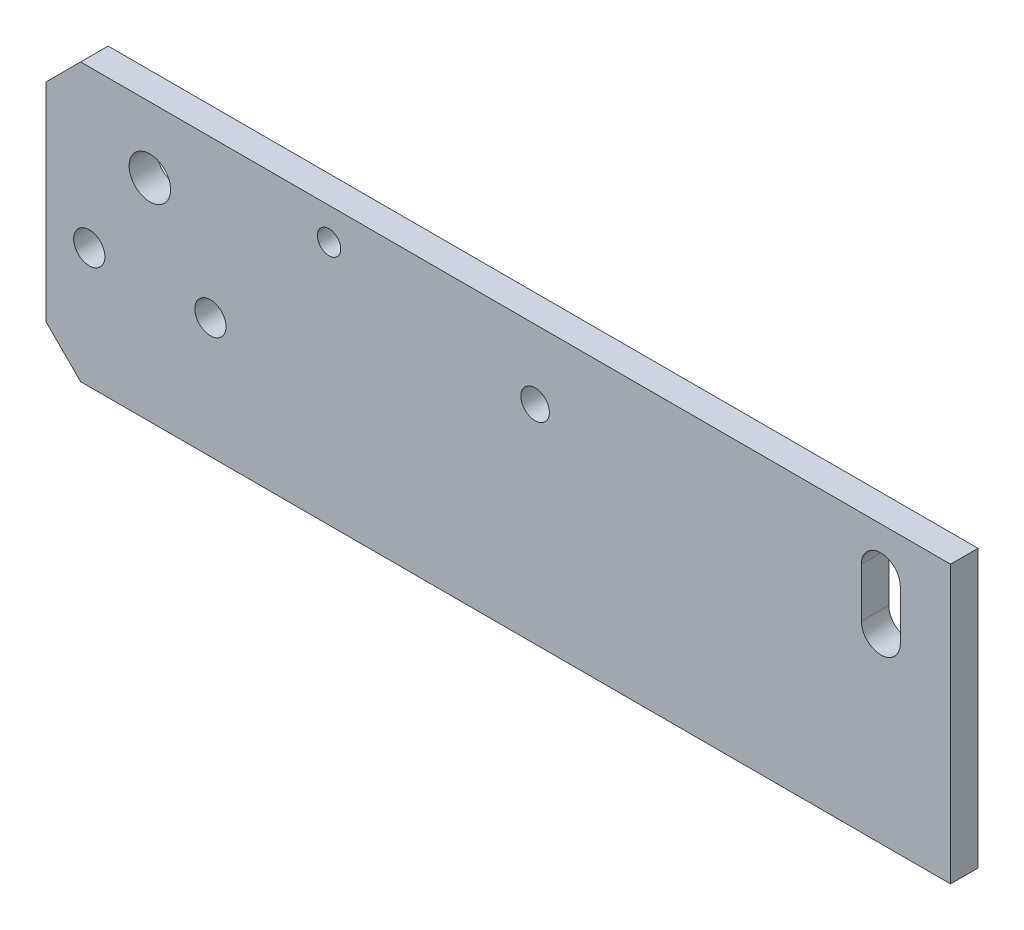
ISO-10303-21;
HEADER;
FILE_DESCRIPTION(('STEP AP214'),'2;1');
FILE_NAME('part.step','',(''),(''),'','','');
FILE_SCHEMA(('AUTOMOTIVE_DESIGN { 1 0 10303 214 1 1 1 1 }'));
ENDSEC;
DATA;
#1=APPLICATION_CONTEXT('core data for automotive mechanical design processes');
#2=APPLICATION_PROTOCOL_DEFINITION('international standard','automotive_design',2000,#1);
#3=PRODUCT_CONTEXT('',#1,'mechanical');
#4=PRODUCT('Part','Part','',(#3));
#5=PRODUCT_RELATED_PRODUCT_CATEGORY('part','',(#4));
#6=PRODUCT_DEFINITION_FORMATION('','',#4);
#7=PRODUCT_DEFINITION_CONTEXT('part definition',#1,'design');
#8=PRODUCT_DEFINITION('design','',#6,#7);
#9=PRODUCT_DEFINITION_SHAPE('','',#8);
#10=(LENGTH_UNIT() NAMED_UNIT(*) SI_UNIT(.MILLI.,.METRE.));
#11=(NAMED_UNIT(*) PLANE_ANGLE_UNIT() SI_UNIT($,.RADIAN.));
#12=(NAMED_UNIT(*) SI_UNIT($,.STERADIAN.) SOLID_ANGLE_UNIT());
#13=UNCERTAINTY_MEASURE_WITH_UNIT(LENGTH_MEASURE(1.E-05),#10,'distance_accuracy_value','');
#14=(GEOMETRIC_REPRESENTATION_CONTEXT(3) GLOBAL_UNCERTAINTY_ASSIGNED_CONTEXT((#13)) GLOBAL_UNIT_ASSIGNED_CONTEXT((#10,
#11,#12)) REPRESENTATION_CONTEXT('',''));
#15=CARTESIAN_POINT('',(0.,0.,0.));
#16=DIRECTION('',(0.,0.,1.));
#17=DIRECTION('',(1.,0.,0.));
#18=AXIS2_PLACEMENT_3D('',#15,#16,#17);
#19=CARTESIAN_POINT('',(28.,33.,-3.175));
#20=DIRECTION('',(1.,0.,0.));
#21=DIRECTION('',(0.,1.,0.));
#22=AXIS2_PLACEMENT_3D('',#19,#20,#21);
#23=PLANE('',#22);
#24=DIRECTION('',(0.,1.,0.));
#25=VECTOR('',#24,1.);
#26=CARTESIAN_POINT('',(28.,33.,0.));
#27=LINE('',#26,#25);
#28=CARTESIAN_POINT('',(28.,1.,0.));
#29=VERTEX_POINT('',#28);
#30=CARTESIAN_POINT('',(28.,33.,0.));
#31=VERTEX_POINT('',#30);
#32=EDGE_CURVE('E178',#29,#31,#27,.T.);
#33=ORIENTED_EDGE('',*,*,#32,.F.);
#34=DIRECTION('',(0.,0.,1.));
#35=VECTOR('',#34,1.);
#36=CARTESIAN_POINT('',(28.,1.,-3.175));
#37=LINE('',#36,#35);
#38=CARTESIAN_POINT('',(28.,1.,-3.175));
#39=VERTEX_POINT('',#38);
#40=EDGE_CURVE('E202',#39,#29,#37,.T.);
#41=ORIENTED_EDGE('',*,*,#40,.F.);
#42=DIRECTION('',(0.,1.,0.));
#43=VECTOR('',#42,1.);
#44=CARTESIAN_POINT('',(28.,33.,-3.175));
#45=LINE('',#44,#43);
#46=CARTESIAN_POINT('',(28.,33.,-3.175));
#47=VERTEX_POINT('',#46);
#48=EDGE_CURVE('E181',#39,#47,#45,.T.);
#49=ORIENTED_EDGE('',*,*,#48,.T.);
#50=DIRECTION('',(0.,0.,1.));
#51=VECTOR('',#50,1.);
#52=CARTESIAN_POINT('',(28.,33.,-3.175));
#53=LINE('',#52,#51);
#54=EDGE_CURVE('E192',#47,#31,#53,.T.);
#55=ORIENTED_EDGE('',*,*,#54,.T.);
#56=EDGE_LOOP('',(#33,#41,#49,#55));
#57=FACE_BOUND('',#56,.T.);
#58=ADVANCED_FACE('F47',(#57),#23,.T.);
#59=CARTESIAN_POINT('',(28.,1.,-3.175));
#60=DIRECTION('',(0.,-1.,0.));
#61=DIRECTION('',(1.,0.,0.));
#62=AXIS2_PLACEMENT_3D('',#59,#60,#61);
#63=PLANE('',#62);
#64=DIRECTION('',(1.,0.,0.));
#65=VECTOR('',#64,1.);
#66=CARTESIAN_POINT('',(28.,1.,0.));
#67=LINE('',#66,#65);
#68=CARTESIAN_POINT('',(-72.5160000000001,0.999999999999987,0.));
#69=VERTEX_POINT('',#68);
#70=EDGE_CURVE('E185',#69,#29,#67,.T.);
#71=ORIENTED_EDGE('',*,*,#70,.F.);
#72=DIRECTION('',(0.,0.,-1.));
#73=VECTOR('',#72,1.);
#74=CARTESIAN_POINT('',(-72.5160000000001,0.999999999999987,-3.175));
#75=LINE('',#74,#73);
#76=CARTESIAN_POINT('',(-72.5160000000001,0.999999999999987,-3.175));
#77=VERTEX_POINT('',#76);
#78=EDGE_CURVE('E70',#69,#77,#75,.T.);
#79=ORIENTED_EDGE('',*,*,#78,.T.);
#80=DIRECTION('',(1.,0.,0.));
#81=VECTOR('',#80,1.);
#82=CARTESIAN_POINT('',(28.,1.,-3.175));
#83=LINE('',#82,#81);
#84=EDGE_CURVE('E190',#77,#39,#83,.T.);
#85=ORIENTED_EDGE('',*,*,#84,.T.);
#86=ORIENTED_EDGE('',*,*,#40,.T.);
#87=EDGE_LOOP('',(#71,#79,#85,#86));
#88=FACE_BOUND('',#87,.T.);
#89=ADVANCED_FACE('F227',(#88),#63,.T.);
#90=CARTESIAN_POINT('',(-76.5160000000001,33.,-3.175));
#91=DIRECTION('',(-1.,0.,0.));
#92=DIRECTION('',(0.,-1.,0.));
#93=AXIS2_PLACEMENT_3D('',#90,#91,#92);
#94=PLANE('',#93);
#95=DIRECTION('',(0.,-1.,0.));
#96=VECTOR('',#95,1.);
#97=CARTESIAN_POINT('',(-76.5160000000001,33.,-3.175));
#98=LINE('',#97,#96);
#99=CARTESIAN_POINT('',(-76.5160000000001,29.,-3.175));
#100=VERTEX_POINT('',#99);
#101=CARTESIAN_POINT('',(-76.5160000000001,4.99999999999999,-3.175));
#102=VERTEX_POINT('',#101);
#103=EDGE_CURVE('E187',#100,#102,#98,.T.);
#104=ORIENTED_EDGE('',*,*,#103,.T.);
#105=DIRECTION('',(0.,0.,1.));
#106=VECTOR('',#105,1.);
#107=CARTESIAN_POINT('',(-76.5160000000001,4.99999999999999,-3.175));
#108=LINE('',#107,#106);
#109=CARTESIAN_POINT('',(-76.5160000000001,4.99999999999999,0.));
#110=VERTEX_POINT('',#109);
#111=EDGE_CURVE('E208',#102,#110,#108,.T.);
#112=ORIENTED_EDGE('',*,*,#111,.T.);
#113=DIRECTION('',(0.,-1.,0.));
#114=VECTOR('',#113,1.);
#115=CARTESIAN_POINT('',(-76.5160000000001,33.,0.));
#116=LINE('',#115,#114);
#117=CARTESIAN_POINT('',(-76.5160000000001,29.,0.));
#118=VERTEX_POINT('',#117);
#119=EDGE_CURVE('E198',#118,#110,#116,.T.);
#120=ORIENTED_EDGE('',*,*,#119,.F.);
#121=DIRECTION('',(0.,0.,-1.));
#122=VECTOR('',#121,1.);
#123=CARTESIAN_POINT('',(-76.5160000000001,29.,-3.175));
#124=LINE('',#123,#122);
#125=EDGE_CURVE('E205',#118,#100,#124,.T.);
#126=ORIENTED_EDGE('',*,*,#125,.T.);
#127=EDGE_LOOP('',(#104,#112,#120,#126));
#128=FACE_BOUND('',#127,.T.);
#129=ADVANCED_FACE('F221',(#128),#94,.T.);
#130=CARTESIAN_POINT('',(28.,33.,-3.175));
#131=DIRECTION('',(0.,1.,0.));
#132=DIRECTION('',(-1.,0.,0.));
#133=AXIS2_PLACEMENT_3D('',#130,#131,#132);
#134=PLANE('',#133);
#135=DIRECTION('',(-1.,0.,0.));
#136=VECTOR('',#135,1.);
#137=CARTESIAN_POINT('',(28.,33.,-3.175));
#138=LINE('',#137,#136);
#139=CARTESIAN_POINT('',(-72.5160000000001,33.,-3.175));
#140=VERTEX_POINT('',#139);
#141=EDGE_CURVE('E184',#47,#140,#138,.T.);
#142=ORIENTED_EDGE('',*,*,#141,.T.);
#143=DIRECTION('',(0.,0.,1.));
#144=VECTOR('',#143,1.);
#145=CARTESIAN_POINT('',(-72.5160000000001,33.,-3.175));
#146=LINE('',#145,#144);
#147=CARTESIAN_POINT('',(-72.5160000000001,33.,0.));
#148=VERTEX_POINT('',#147);
#149=EDGE_CURVE('E13',#140,#148,#146,.T.);
#150=ORIENTED_EDGE('',*,*,#149,.T.);
#151=DIRECTION('',(-1.,0.,0.));
#152=VECTOR('',#151,1.);
#153=CARTESIAN_POINT('',(28.,33.,0.));
#154=LINE('',#153,#152);
#155=EDGE_CURVE('E195',#31,#148,#154,.T.);
#156=ORIENTED_EDGE('',*,*,#155,.F.);
#157=ORIENTED_EDGE('',*,*,#54,.F.);
#158=EDGE_LOOP('',(#142,#150,#156,#157));
#159=FACE_BOUND('',#158,.T.);
#160=ADVANCED_FACE('F233',(#159),#134,.T.);
#161=CARTESIAN_POINT('',(0.,0.,-3.175));
#162=DIRECTION('',(0.,0.,-1.));
#163=DIRECTION('',(-1.,0.,0.));
#164=AXIS2_PLACEMENT_3D('',#161,#162,#163);
#165=PLANE('',#164);
#166=CARTESIAN_POINT('',(-43.81,29.3078,-3.175));
#167=DIRECTION('',(0.,0.,1.));
#168=DIRECTION('',(1.,0.,0.));
#169=AXIS2_PLACEMENT_3D('',#166,#167,#168);
#170=CIRCLE('',#169,1.35255);
#171=CARTESIAN_POINT('',(-42.45745,29.3078,-3.175));
#172=VERTEX_POINT('',#171);
#173=EDGE_CURVE('E299',#172,#172,#170,.T.);
#174=ORIENTED_EDGE('',*,*,#173,.T.);
#175=EDGE_LOOP('',(#174));
#176=FACE_BOUND('',#175,.T.);
#177=CARTESIAN_POINT('',(-20.,25.,-3.175));
#178=DIRECTION('',(0.,0.,-1.));
#179=DIRECTION('',(-1.,0.,0.));
#180=AXIS2_PLACEMENT_3D('',#177,#178,#179);
#181=CIRCLE('',#180,1.65);
#182=CARTESIAN_POINT('',(-21.65,25.,-3.175));
#183=VERTEX_POINT('',#182);
#184=EDGE_CURVE('E297',#183,#183,#181,.T.);
#185=ORIENTED_EDGE('',*,*,#184,.F.);
#186=EDGE_LOOP('',(#185));
#187=FACE_BOUND('',#186,.T.);
#188=CARTESIAN_POINT('',(-57.5160000000001,14.9,-3.175));
#189=DIRECTION('',(0.,0.,1.));
#190=DIRECTION('',(1.,0.,0.));
#191=AXIS2_PLACEMENT_3D('',#188,#189,#190);
#192=CIRCLE('',#191,1.8034);
#193=CARTESIAN_POINT('',(-55.7126000000001,14.9,-3.175));
#194=VERTEX_POINT('',#193);
#195=EDGE_CURVE('E308',#194,#194,#192,.T.);
#196=ORIENTED_EDGE('',*,*,#195,.T.);
#197=EDGE_LOOP('',(#196));
#198=FACE_BOUND('',#197,.T.);
#199=CARTESIAN_POINT('',(-71.5160000000001,14.9,-3.175));
#200=DIRECTION('',(0.,0.,1.));
#201=DIRECTION('',(1.,0.,0.));
#202=AXIS2_PLACEMENT_3D('',#199,#200,#201);
#203=CIRCLE('',#202,1.8034);
#204=CARTESIAN_POINT('',(-69.7126000000001,14.9,-3.175));
#205=VERTEX_POINT('',#204);
#206=EDGE_CURVE('E165',#205,#205,#203,.T.);
#207=ORIENTED_EDGE('',*,*,#206,.T.);
#208=EDGE_LOOP('',(#207));
#209=FACE_BOUND('',#208,.T.);
#210=CARTESIAN_POINT('',(19.9481298558837,27.8529342794817,-3.175));
#211=DIRECTION('',(0.,0.,1.));
#212=DIRECTION('',(1.,0.,0.));
#213=AXIS2_PLACEMENT_3D('',#210,#211,#212);
#214=CIRCLE('',#213,2.25);
#215=CARTESIAN_POINT('',(22.1981298558837,27.8529342794817,-3.175));
#216=VERTEX_POINT('',#215);
#217=CARTESIAN_POINT('',(17.6981298558837,27.8529342794817,-3.175));
#218=VERTEX_POINT('',#217);
#219=EDGE_CURVE('E131',#216,#218,#214,.T.);
#220=ORIENTED_EDGE('',*,*,#219,.T.);
#221=DIRECTION('',(0.,-1.,0.));
#222=VECTOR('',#221,1.);
#223=CARTESIAN_POINT('',(17.6981298558837,27.8529342794817,-3.175));
#224=LINE('',#223,#222);
#225=CARTESIAN_POINT('',(17.6981298558837,22.1470657205183,-3.175));
#226=VERTEX_POINT('',#225);
#227=EDGE_CURVE('E143',#218,#226,#224,.T.);
#228=ORIENTED_EDGE('',*,*,#227,.T.);
#229=CARTESIAN_POINT('',(19.9481298558837,22.1470657205183,-3.175));
#230=DIRECTION('',(0.,0.,1.));
#231=DIRECTION('',(1.,0.,0.));
#232=AXIS2_PLACEMENT_3D('',#229,#230,#231);
#233=CIRCLE('',#232,2.25);
#234=CARTESIAN_POINT('',(22.1981298558837,22.1470657205183,-3.175));
#235=VERTEX_POINT('',#234);
#236=EDGE_CURVE('E147',#226,#235,#233,.T.);
#237=ORIENTED_EDGE('',*,*,#236,.T.);
#238=DIRECTION('',(0.,1.,0.));
#239=VECTOR('',#238,1.);
#240=CARTESIAN_POINT('',(22.1981298558837,27.8529342794817,-3.175));
#241=LINE('',#240,#239);
#242=EDGE_CURVE('E139',#235,#216,#241,.T.);
#243=ORIENTED_EDGE('',*,*,#242,.T.);
#244=EDGE_LOOP('',(#220,#228,#237,#243));
#245=FACE_BOUND('',#244,.T.);
#246=CARTESIAN_POINT('',(-64.5160000000001,25.4,-3.175));
#247=DIRECTION('',(0.,0.,1.));
#248=DIRECTION('',(1.,0.,0.));
#249=AXIS2_PLACEMENT_3D('',#246,#247,#248);
#250=CIRCLE('',#249,2.40000000001474);
#251=CARTESIAN_POINT('',(-62.1159999999854,25.4,-3.175));
#252=VERTEX_POINT('',#251);
#253=EDGE_CURVE('E175',#252,#252,#250,.T.);
#254=ORIENTED_EDGE('',*,*,#253,.T.);
#255=EDGE_LOOP('',(#254));
#256=FACE_BOUND('',#255,.T.);
#257=ORIENTED_EDGE('',*,*,#84,.F.);
#258=DIRECTION('',(0.707106781186548,-0.707106781186547,0.));
#259=VECTOR('',#258,1.);
#260=CARTESIAN_POINT('',(-35.758,-35.7580000000001,-3.175));
#261=LINE('',#260,#259);
#262=EDGE_CURVE('E55',#77,#102,#261,.F.);
#263=ORIENTED_EDGE('',*,*,#262,.T.);
#264=ORIENTED_EDGE('',*,*,#103,.F.);
#265=DIRECTION('',(-0.707106781186548,-0.707106781186548,0.));
#266=VECTOR('',#265,1.);
#267=CARTESIAN_POINT('',(-52.758,52.758,-3.175));
#268=LINE('',#267,#266);
#269=EDGE_CURVE('E62',#100,#140,#268,.F.);
#270=ORIENTED_EDGE('',*,*,#269,.T.);
#271=ORIENTED_EDGE('',*,*,#141,.F.);
#272=ORIENTED_EDGE('',*,*,#48,.F.);
#273=EDGE_LOOP('',(#257,#263,#264,#270,#271,#272));
#274=FACE_BOUND('',#273,.T.);
#275=ADVANCED_FACE('F149',(#176,#187,#198,#209,#245,#256,#274),#165,.T.);
#276=CARTESIAN_POINT('',(0.,0.,0.));
#277=DIRECTION('',(0.,0.,-1.));
#278=DIRECTION('',(-1.,0.,0.));
#279=AXIS2_PLACEMENT_3D('',#276,#277,#278);
#280=PLANE('',#279);
#281=CARTESIAN_POINT('',(-43.81,29.3078,0.));
#282=DIRECTION('',(0.,0.,1.));
#283=DIRECTION('',(1.,0.,0.));
#284=AXIS2_PLACEMENT_3D('',#281,#282,#283);
#285=CIRCLE('',#284,1.35254999999999);
#286=CARTESIAN_POINT('',(-42.45745,29.3078,0.));
#287=VERTEX_POINT('',#286);
#288=EDGE_CURVE('E304',#287,#287,#285,.T.);
#289=ORIENTED_EDGE('',*,*,#288,.F.);
#290=EDGE_LOOP('',(#289));
#291=FACE_BOUND('',#290,.T.);
#292=CARTESIAN_POINT('',(-20.,25.,0.));
#293=DIRECTION('',(0.,0.,-1.));
#294=DIRECTION('',(-1.,0.,0.));
#295=AXIS2_PLACEMENT_3D('',#292,#293,#294);
#296=CIRCLE('',#295,1.65);
#297=CARTESIAN_POINT('',(-21.65,25.,0.));
#298=VERTEX_POINT('',#297);
#299=EDGE_CURVE('E294',#298,#298,#296,.T.);
#300=ORIENTED_EDGE('',*,*,#299,.T.);
#301=EDGE_LOOP('',(#300));
#302=FACE_BOUND('',#301,.T.);
#303=CARTESIAN_POINT('',(-57.5160000000001,14.9,0.));
#304=DIRECTION('',(0.,0.,1.));
#305=DIRECTION('',(1.,0.,0.));
#306=AXIS2_PLACEMENT_3D('',#303,#304,#305);
#307=CIRCLE('',#306,1.8034);
#308=CARTESIAN_POINT('',(-55.7126000000001,14.9,0.));
#309=VERTEX_POINT('',#308);
#310=EDGE_CURVE('E301',#309,#309,#307,.T.);
#311=ORIENTED_EDGE('',*,*,#310,.F.);
#312=EDGE_LOOP('',(#311));
#313=FACE_BOUND('',#312,.T.);
#314=CARTESIAN_POINT('',(-71.5160000000001,14.9,0.));
#315=DIRECTION('',(0.,0.,1.));
#316=DIRECTION('',(1.,0.,0.));
#317=AXIS2_PLACEMENT_3D('',#314,#315,#316);
#318=CIRCLE('',#317,1.8034);
#319=CARTESIAN_POINT('',(-69.7126000000001,14.9,0.));
#320=VERTEX_POINT('',#319);
#321=EDGE_CURVE('E158',#320,#320,#318,.T.);
#322=ORIENTED_EDGE('',*,*,#321,.F.);
#323=EDGE_LOOP('',(#322));
#324=FACE_BOUND('',#323,.T.);
#325=DIRECTION('',(0.,-1.,0.));
#326=VECTOR('',#325,1.);
#327=CARTESIAN_POINT('',(17.6981298558837,27.8529342794817,0.));
#328=LINE('',#327,#326);
#329=CARTESIAN_POINT('',(17.6981298558837,27.8529342794817,0.));
#330=VERTEX_POINT('',#329);
#331=CARTESIAN_POINT('',(17.6981298558837,22.1470657205183,0.));
#332=VERTEX_POINT('',#331);
#333=EDGE_CURVE('E164',#330,#332,#328,.T.);
#334=ORIENTED_EDGE('',*,*,#333,.F.);
#335=CARTESIAN_POINT('',(19.9481298558837,27.8529342794817,0.));
#336=DIRECTION('',(0.,0.,1.));
#337=DIRECTION('',(1.,0.,0.));
#338=AXIS2_PLACEMENT_3D('',#335,#336,#337);
#339=CIRCLE('',#338,2.25);
#340=CARTESIAN_POINT('',(22.1981298558837,27.8529342794817,0.));
#341=VERTEX_POINT('',#340);
#342=EDGE_CURVE('E134',#341,#330,#339,.T.);
#343=ORIENTED_EDGE('',*,*,#342,.F.);
#344=DIRECTION('',(0.,1.,0.));
#345=VECTOR('',#344,1.);
#346=CARTESIAN_POINT('',(22.1981298558837,27.8529342794817,0.));
#347=LINE('',#346,#345);
#348=CARTESIAN_POINT('',(22.1981298558837,22.1470657205183,0.));
#349=VERTEX_POINT('',#348);
#350=EDGE_CURVE('E152',#349,#341,#347,.T.);
#351=ORIENTED_EDGE('',*,*,#350,.F.);
#352=CARTESIAN_POINT('',(19.9481298558837,22.1470657205183,0.));
#353=DIRECTION('',(0.,0.,1.));
#354=DIRECTION('',(1.,0.,0.));
#355=AXIS2_PLACEMENT_3D('',#352,#353,#354);
#356=CIRCLE('',#355,2.25);
#357=EDGE_CURVE('E155',#332,#349,#356,.T.);
#358=ORIENTED_EDGE('',*,*,#357,.F.);
#359=EDGE_LOOP('',(#334,#343,#351,#358));
#360=FACE_BOUND('',#359,.T.);
#361=CARTESIAN_POINT('',(-64.5160000000001,25.4,0.));
#362=DIRECTION('',(0.,0.,1.));
#363=DIRECTION('',(1.,0.,0.));
#364=AXIS2_PLACEMENT_3D('',#361,#362,#363);
#365=CIRCLE('',#364,2.40000000001474);
#366=CARTESIAN_POINT('',(-62.1159999999854,25.4,0.));
#367=VERTEX_POINT('',#366);
#368=EDGE_CURVE('E171',#367,#367,#365,.T.);
#369=ORIENTED_EDGE('',*,*,#368,.F.);
#370=EDGE_LOOP('',(#369));
#371=FACE_BOUND('',#370,.T.);
#372=ORIENTED_EDGE('',*,*,#119,.T.);
#373=DIRECTION('',(-0.707106781186548,0.707106781186547,0.));
#374=VECTOR('',#373,1.);
#375=CARTESIAN_POINT('',(-76.5160000000001,4.99999999999999,0.));
#376=LINE('',#375,#374);
#377=EDGE_CURVE('E213',#110,#69,#376,.F.);
#378=ORIENTED_EDGE('',*,*,#377,.T.);
#379=ORIENTED_EDGE('',*,*,#70,.T.);
#380=ORIENTED_EDGE('',*,*,#32,.T.);
#381=ORIENTED_EDGE('',*,*,#155,.T.);
#382=DIRECTION('',(0.707106781186548,0.707106781186548,0.));
#383=VECTOR('',#382,1.);
#384=CARTESIAN_POINT('',(-72.5160000000001,33.,0.));
#385=LINE('',#384,#383);
#386=EDGE_CURVE('E211',#148,#118,#385,.F.);
#387=ORIENTED_EDGE('',*,*,#386,.T.);
#388=EDGE_LOOP('',(#372,#378,#379,#380,#381,#387));
#389=FACE_BOUND('',#388,.T.);
#390=ADVANCED_FACE('F226',(#291,#302,#313,#324,#360,#371,#389),#280,.F.);
#391=CARTESIAN_POINT('',(-64.5160000000001,25.4,-3.175));
#392=DIRECTION('',(0.,0.,1.));
#393=DIRECTION('',(1.,0.,0.));
#394=AXIS2_PLACEMENT_3D('',#391,#392,#393);
#395=CYLINDRICAL_SURFACE('',#394,2.40000000001474);
#396=ORIENTED_EDGE('',*,*,#253,.F.);
#397=EDGE_LOOP('',(#396));
#398=FACE_BOUND('',#397,.T.);
#399=ORIENTED_EDGE('',*,*,#368,.T.);
#400=EDGE_LOOP('',(#399));
#401=FACE_BOUND('',#400,.T.);
#402=ADVANCED_FACE('F259',(#398,#401),#395,.F.);
#403=CARTESIAN_POINT('',(19.9481298558837,27.8529342794817,-3.175));
#404=DIRECTION('',(0.,0.,1.));
#405=DIRECTION('',(1.,0.,0.));
#406=AXIS2_PLACEMENT_3D('',#403,#404,#405);
#407=CYLINDRICAL_SURFACE('',#406,2.25);
#408=ORIENTED_EDGE('',*,*,#342,.T.);
#409=DIRECTION('',(0.,0.,1.));
#410=VECTOR('',#409,1.);
#411=CARTESIAN_POINT('',(17.6981298558837,27.8529342794817,-3.175));
#412=LINE('',#411,#410);
#413=EDGE_CURVE('E127',#218,#330,#412,.T.);
#414=ORIENTED_EDGE('',*,*,#413,.F.);
#415=ORIENTED_EDGE('',*,*,#219,.F.);
#416=DIRECTION('',(0.,0.,1.));
#417=VECTOR('',#416,1.);
#418=CARTESIAN_POINT('',(22.1981298558837,27.8529342794817,-3.175));
#419=LINE('',#418,#417);
#420=EDGE_CURVE('E169',#216,#341,#419,.T.);
#421=ORIENTED_EDGE('',*,*,#420,.T.);
#422=EDGE_LOOP('',(#408,#414,#415,#421));
#423=FACE_BOUND('',#422,.T.);
#424=ADVANCED_FACE('F129',(#423),#407,.F.);
#425=CARTESIAN_POINT('',(22.1981298558837,27.8529342794817,-3.175));
#426=DIRECTION('',(1.,0.,0.));
#427=DIRECTION('',(0.,0.,-1.));
#428=AXIS2_PLACEMENT_3D('',#425,#426,#427);
#429=PLANE('',#428);
#430=ORIENTED_EDGE('',*,*,#350,.T.);
#431=ORIENTED_EDGE('',*,*,#420,.F.);
#432=ORIENTED_EDGE('',*,*,#242,.F.);
#433=DIRECTION('',(0.,0.,1.));
#434=VECTOR('',#433,1.);
#435=CARTESIAN_POINT('',(22.1981298558837,22.1470657205183,-3.175));
#436=LINE('',#435,#434);
#437=EDGE_CURVE('E172',#235,#349,#436,.T.);
#438=ORIENTED_EDGE('',*,*,#437,.T.);
#439=EDGE_LOOP('',(#430,#431,#432,#438));
#440=FACE_BOUND('',#439,.T.);
#441=ADVANCED_FACE('F269',(#440),#429,.F.);
#442=CARTESIAN_POINT('',(19.9481298558837,22.1470657205183,-3.175));
#443=DIRECTION('',(0.,0.,1.));
#444=DIRECTION('',(1.,0.,0.));
#445=AXIS2_PLACEMENT_3D('',#442,#443,#444);
#446=CYLINDRICAL_SURFACE('',#445,2.25);
#447=ORIENTED_EDGE('',*,*,#357,.T.);
#448=ORIENTED_EDGE('',*,*,#437,.F.);
#449=ORIENTED_EDGE('',*,*,#236,.F.);
#450=DIRECTION('',(0.,0.,1.));
#451=VECTOR('',#450,1.);
#452=CARTESIAN_POINT('',(17.6981298558837,22.1470657205183,-3.175));
#453=LINE('',#452,#451);
#454=EDGE_CURVE('E138',#226,#332,#453,.T.);
#455=ORIENTED_EDGE('',*,*,#454,.T.);
#456=EDGE_LOOP('',(#447,#448,#449,#455));
#457=FACE_BOUND('',#456,.T.);
#458=ADVANCED_FACE('F273',(#457),#446,.F.);
#459=CARTESIAN_POINT('',(17.6981298558837,27.8529342794817,-3.175));
#460=DIRECTION('',(-1.,0.,0.));
#461=DIRECTION('',(0.,0.,1.));
#462=AXIS2_PLACEMENT_3D('',#459,#460,#461);
#463=PLANE('',#462);
#464=ORIENTED_EDGE('',*,*,#333,.T.);
#465=ORIENTED_EDGE('',*,*,#454,.F.);
#466=ORIENTED_EDGE('',*,*,#227,.F.);
#467=ORIENTED_EDGE('',*,*,#413,.T.);
#468=EDGE_LOOP('',(#464,#465,#466,#467));
#469=FACE_BOUND('',#468,.T.);
#470=ADVANCED_FACE('F144',(#469),#463,.F.);
#471=CARTESIAN_POINT('',(-71.5160000000001,14.9,-3.175));
#472=DIRECTION('',(0.,0.,1.));
#473=DIRECTION('',(1.,0.,0.));
#474=AXIS2_PLACEMENT_3D('',#471,#472,#473);
#475=CYLINDRICAL_SURFACE('',#474,1.8034);
#476=ORIENTED_EDGE('',*,*,#206,.F.);
#477=EDGE_LOOP('',(#476));
#478=FACE_BOUND('',#477,.T.);
#479=ORIENTED_EDGE('',*,*,#321,.T.);
#480=EDGE_LOOP('',(#479));
#481=FACE_BOUND('',#480,.T.);
#482=ADVANCED_FACE('F272',(#478,#481),#475,.F.);
#483=CARTESIAN_POINT('',(-57.5160000000001,14.9,-3.175));
#484=DIRECTION('',(0.,0.,1.));
#485=DIRECTION('',(1.,0.,0.));
#486=AXIS2_PLACEMENT_3D('',#483,#484,#485);
#487=CYLINDRICAL_SURFACE('',#486,1.8034);
#488=ORIENTED_EDGE('',*,*,#195,.F.);
#489=EDGE_LOOP('',(#488));
#490=FACE_BOUND('',#489,.T.);
#491=ORIENTED_EDGE('',*,*,#310,.T.);
#492=EDGE_LOOP('',(#491));
#493=FACE_BOUND('',#492,.T.);
#494=ADVANCED_FACE('F282',(#490,#493),#487,.F.);
#495=CARTESIAN_POINT('',(-20.,25.,-3.175));
#496=DIRECTION('',(0.,0.,-1.));
#497=DIRECTION('',(-1.,0.,0.));
#498=AXIS2_PLACEMENT_3D('',#495,#496,#497);
#499=CYLINDRICAL_SURFACE('',#498,1.65);
#500=ORIENTED_EDGE('',*,*,#299,.F.);
#501=EDGE_LOOP('',(#500));
#502=FACE_BOUND('',#501,.T.);
#503=ORIENTED_EDGE('',*,*,#184,.T.);
#504=EDGE_LOOP('',(#503));
#505=FACE_BOUND('',#504,.T.);
#506=ADVANCED_FACE('F245',(#502,#505),#499,.F.);
#507=CARTESIAN_POINT('',(-76.5160000000001,4.99999999999999,-3.175));
#508=DIRECTION('',(0.707106781186547,0.707106781186548,0.));
#509=DIRECTION('',(0.,0.,1.));
#510=AXIS2_PLACEMENT_3D('',#507,#508,#509);
#511=PLANE('',#510);
#512=ORIENTED_EDGE('',*,*,#262,.F.);
#513=ORIENTED_EDGE('',*,*,#78,.F.);
#514=ORIENTED_EDGE('',*,*,#377,.F.);
#515=ORIENTED_EDGE('',*,*,#111,.F.);
#516=EDGE_LOOP('',(#512,#513,#514,#515));
#517=FACE_BOUND('',#516,.T.);
#518=ADVANCED_FACE('F224',(#517),#511,.F.);
#519=CARTESIAN_POINT('',(-72.5160000000001,33.,-3.175));
#520=DIRECTION('',(0.707106781186547,-0.707106781186547,0.));
#521=DIRECTION('',(0.,0.,1.));
#522=AXIS2_PLACEMENT_3D('',#519,#520,#521);
#523=PLANE('',#522);
#524=ORIENTED_EDGE('',*,*,#269,.F.);
#525=ORIENTED_EDGE('',*,*,#125,.F.);
#526=ORIENTED_EDGE('',*,*,#386,.F.);
#527=ORIENTED_EDGE('',*,*,#149,.F.);
#528=EDGE_LOOP('',(#524,#525,#526,#527));
#529=FACE_BOUND('',#528,.T.);
#530=ADVANCED_FACE('F49',(#529),#523,.F.);
#531=CARTESIAN_POINT('',(-43.81,29.3078,0.));
#532=DIRECTION('',(0.,0.,1.));
#533=DIRECTION('',(1.,0.,0.));
#534=AXIS2_PLACEMENT_3D('',#531,#532,#533);
#535=CYLINDRICAL_SURFACE('',#534,1.35254999999999);
#536=ORIENTED_EDGE('',*,*,#173,.F.);
#537=EDGE_LOOP('',(#536));
#538=FACE_BOUND('',#537,.T.);
#539=ORIENTED_EDGE('',*,*,#288,.T.);
#540=EDGE_LOOP('',(#539));
#541=FACE_BOUND('',#540,.T.);
#542=ADVANCED_FACE('F237',(#538,#541),#535,.F.);
#543=CLOSED_SHELL('',(#58,#89,#129,#160,#275,#390,#402,#424,#441,#458,#470,#482,#494,#506,#518,
#530,#542));
#544=MANIFOLD_SOLID_BREP('B2',#543);
#545=ADVANCED_BREP_SHAPE_REPRESENTATION('',(#18,#544),#14);
#546=SHAPE_DEFINITION_REPRESENTATION(#9,#545);
ENDSEC;
END-ISO-10303-21;
